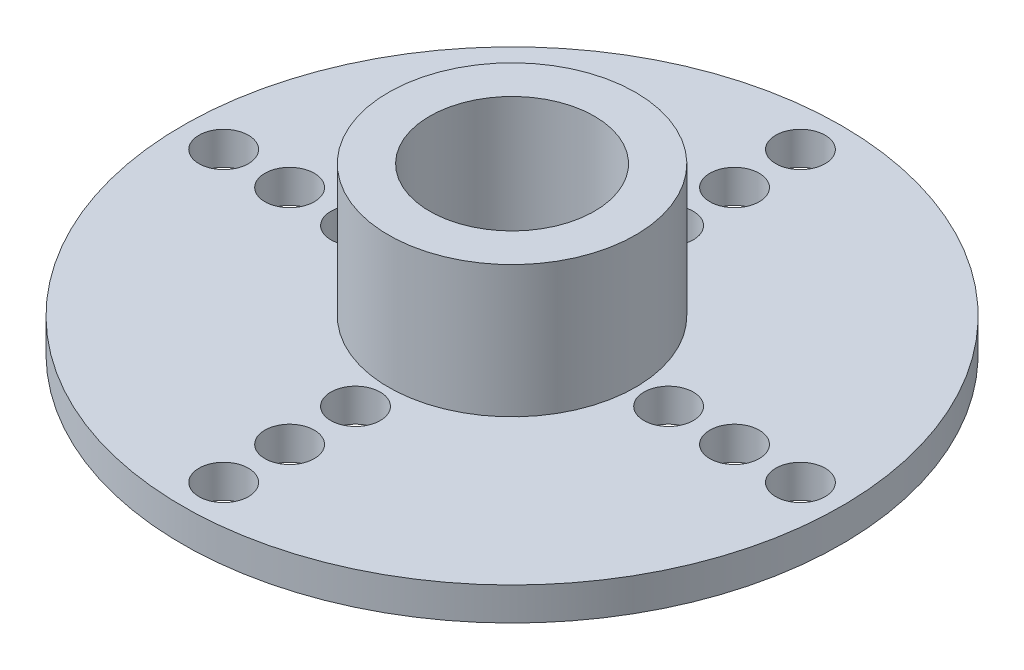
ISO-10303-21;
HEADER;
FILE_DESCRIPTION(('STEP AP214'),'2;1');
FILE_NAME('part.step','',(''),(''),'','','');
FILE_SCHEMA(('AUTOMOTIVE_DESIGN { 1 0 10303 214 1 1 1 1 }'));
ENDSEC;
DATA;
#1=APPLICATION_CONTEXT('core data for automotive mechanical design processes');
#2=APPLICATION_PROTOCOL_DEFINITION('international standard','automotive_design',2000,#1);
#3=PRODUCT_CONTEXT('',#1,'mechanical');
#4=PRODUCT('Part','Part','',(#3));
#5=PRODUCT_RELATED_PRODUCT_CATEGORY('part','',(#4));
#6=PRODUCT_DEFINITION_FORMATION('','',#4);
#7=PRODUCT_DEFINITION_CONTEXT('part definition',#1,'design');
#8=PRODUCT_DEFINITION('design','',#6,#7);
#9=PRODUCT_DEFINITION_SHAPE('','',#8);
#10=(LENGTH_UNIT() NAMED_UNIT(*) SI_UNIT(.MILLI.,.METRE.));
#11=(NAMED_UNIT(*) PLANE_ANGLE_UNIT() SI_UNIT($,.RADIAN.));
#12=(NAMED_UNIT(*) SI_UNIT($,.STERADIAN.) SOLID_ANGLE_UNIT());
#13=UNCERTAINTY_MEASURE_WITH_UNIT(LENGTH_MEASURE(1.E-05),#10,'distance_accuracy_value','');
#14=(GEOMETRIC_REPRESENTATION_CONTEXT(3) GLOBAL_UNCERTAINTY_ASSIGNED_CONTEXT((#13)) GLOBAL_UNIT_ASSIGNED_CONTEXT((#10,
#11,#12)) REPRESENTATION_CONTEXT('',''));
#15=CARTESIAN_POINT('',(0.,0.,0.));
#16=DIRECTION('',(0.,0.,1.));
#17=DIRECTION('',(1.,0.,0.));
#18=AXIS2_PLACEMENT_3D('',#15,#16,#17);
#19=CARTESIAN_POINT('',(0.,5.,0.));
#20=DIRECTION('',(0.,-1.,0.));
#21=DIRECTION('',(0.,0.,-1.));
#22=AXIS2_PLACEMENT_3D('',#19,#20,#21);
#23=CYLINDRICAL_SURFACE('',#22,3.75);
#24=CARTESIAN_POINT('',(0.,5.,0.));
#25=DIRECTION('',(0.,-1.,0.));
#26=DIRECTION('',(0.,0.,-1.));
#27=AXIS2_PLACEMENT_3D('',#24,#25,#26);
#28=CIRCLE('',#27,3.75);
#29=CARTESIAN_POINT('',(0.,5.,-3.75));
#30=VERTEX_POINT('',#29);
#31=EDGE_CURVE('E204',#30,#30,#28,.T.);
#32=ORIENTED_EDGE('',*,*,#31,.T.);
#33=EDGE_LOOP('',(#32));
#34=FACE_BOUND('',#33,.T.);
#35=CARTESIAN_POINT('',(0.,1.,0.));
#36=DIRECTION('',(0.,-1.,0.));
#37=DIRECTION('',(0.,0.,-1.));
#38=AXIS2_PLACEMENT_3D('',#35,#36,#37);
#39=CIRCLE('',#38,3.75);
#40=CARTESIAN_POINT('',(0.,1.,-3.75));
#41=VERTEX_POINT('',#40);
#42=EDGE_CURVE('E48',#41,#41,#39,.T.);
#43=ORIENTED_EDGE('',*,*,#42,.F.);
#44=EDGE_LOOP('',(#43));
#45=FACE_BOUND('',#44,.T.);
#46=ADVANCED_FACE('F33',(#34,#45),#23,.T.);
#47=CARTESIAN_POINT('',(0.,1.,-14.75));
#48=DIRECTION('',(0.,-1.,0.));
#49=DIRECTION('',(0.,0.,-1.));
#50=AXIS2_PLACEMENT_3D('',#47,#48,#49);
#51=PLANE('',#50);
#52=CARTESIAN_POINT('',(0.,1.,0.));
#53=DIRECTION('',(0.,-1.,0.));
#54=DIRECTION('',(0.,0.,-1.));
#55=AXIS2_PLACEMENT_3D('',#52,#53,#54);
#56=CIRCLE('',#55,10.);
#57=CARTESIAN_POINT('',(0.,1.,-10.));
#58=VERTEX_POINT('',#57);
#59=EDGE_CURVE('E199',#58,#58,#56,.T.);
#60=ORIENTED_EDGE('',*,*,#59,.F.);
#61=EDGE_LOOP('',(#60));
#62=FACE_BOUND('',#61,.T.);
#63=ORIENTED_EDGE('',*,*,#42,.T.);
#64=EDGE_LOOP('',(#63));
#65=FACE_BOUND('',#64,.T.);
#66=CARTESIAN_POINT('',(1.0413211676572E-13,1.,-4.75));
#67=DIRECTION('',(0.,1.,0.));
#68=DIRECTION('',(0.,0.,1.));
#69=AXIS2_PLACEMENT_3D('',#66,#67,#68);
#70=CIRCLE('',#69,0.75);
#71=CARTESIAN_POINT('',(1.0413211676572E-13,1.,-4.));
#72=VERTEX_POINT('',#71);
#73=EDGE_CURVE('E69',#72,#72,#70,.T.);
#74=ORIENTED_EDGE('',*,*,#73,.F.);
#75=EDGE_LOOP('',(#74));
#76=FACE_BOUND('',#75,.T.);
#77=CARTESIAN_POINT('',(0.,1.,-6.75));
#78=DIRECTION('',(0.,1.,0.));
#79=DIRECTION('',(0.,0.,1.));
#80=AXIS2_PLACEMENT_3D('',#77,#78,#79);
#81=CIRCLE('',#80,0.75);
#82=CARTESIAN_POINT('',(0.,1.,-6.));
#83=VERTEX_POINT('',#82);
#84=EDGE_CURVE('E75',#83,#83,#81,.T.);
#85=ORIENTED_EDGE('',*,*,#84,.F.);
#86=EDGE_LOOP('',(#85));
#87=FACE_BOUND('',#86,.T.);
#88=CARTESIAN_POINT('',(0.,1.,-8.75));
#89=DIRECTION('',(0.,1.,0.));
#90=DIRECTION('',(0.,0.,1.));
#91=AXIS2_PLACEMENT_3D('',#88,#89,#90);
#92=CIRCLE('',#91,0.75);
#93=CARTESIAN_POINT('',(0.,1.,-8.));
#94=VERTEX_POINT('',#93);
#95=EDGE_CURVE('E81',#94,#94,#92,.T.);
#96=ORIENTED_EDGE('',*,*,#95,.F.);
#97=EDGE_LOOP('',(#96));
#98=FACE_BOUND('',#97,.T.);
#99=CARTESIAN_POINT('',(8.75,1.,0.));
#100=DIRECTION('',(0.,-1.,0.));
#101=DIRECTION('',(0.,0.,-1.));
#102=AXIS2_PLACEMENT_3D('',#99,#100,#101);
#103=CIRCLE('',#102,0.749999999999998);
#104=CARTESIAN_POINT('',(8.75,1.,-0.749999999999998));
#105=VERTEX_POINT('',#104);
#106=EDGE_CURVE('E183',#105,#105,#103,.T.);
#107=ORIENTED_EDGE('',*,*,#106,.T.);
#108=EDGE_LOOP('',(#107));
#109=FACE_BOUND('',#108,.T.);
#110=CARTESIAN_POINT('',(6.75,1.,0.));
#111=DIRECTION('',(0.,-1.,0.));
#112=DIRECTION('',(0.,0.,-1.));
#113=AXIS2_PLACEMENT_3D('',#110,#111,#112);
#114=CIRCLE('',#113,0.749999999999999);
#115=CARTESIAN_POINT('',(6.75,1.,-0.749999999999999));
#116=VERTEX_POINT('',#115);
#117=EDGE_CURVE('E186',#116,#116,#114,.T.);
#118=ORIENTED_EDGE('',*,*,#117,.T.);
#119=EDGE_LOOP('',(#118));
#120=FACE_BOUND('',#119,.T.);
#121=CARTESIAN_POINT('',(4.75,1.,0.));
#122=DIRECTION('',(0.,-1.,0.));
#123=DIRECTION('',(0.,0.,-1.));
#124=AXIS2_PLACEMENT_3D('',#121,#122,#123);
#125=CIRCLE('',#124,0.749999999999999);
#126=CARTESIAN_POINT('',(4.75,1.,-0.749999999999999));
#127=VERTEX_POINT('',#126);
#128=EDGE_CURVE('E189',#127,#127,#125,.T.);
#129=ORIENTED_EDGE('',*,*,#128,.T.);
#130=EDGE_LOOP('',(#129));
#131=FACE_BOUND('',#130,.T.);
#132=CARTESIAN_POINT('',(1.0413211676572E-13,1.,4.75));
#133=DIRECTION('',(0.,1.,0.));
#134=DIRECTION('',(0.,0.,-1.));
#135=AXIS2_PLACEMENT_3D('',#132,#133,#134);
#136=CIRCLE('',#135,0.75);
#137=CARTESIAN_POINT('',(1.0413211676572E-13,1.,4.));
#138=VERTEX_POINT('',#137);
#139=EDGE_CURVE('E63',#138,#138,#136,.T.);
#140=ORIENTED_EDGE('',*,*,#139,.F.);
#141=EDGE_LOOP('',(#140));
#142=FACE_BOUND('',#141,.T.);
#143=CARTESIAN_POINT('',(0.,1.,6.75));
#144=DIRECTION('',(0.,1.,0.));
#145=DIRECTION('',(0.,0.,-1.));
#146=AXIS2_PLACEMENT_3D('',#143,#144,#145);
#147=CIRCLE('',#146,0.75);
#148=CARTESIAN_POINT('',(0.,1.,6.));
#149=VERTEX_POINT('',#148);
#150=EDGE_CURVE('E57',#149,#149,#147,.T.);
#151=ORIENTED_EDGE('',*,*,#150,.F.);
#152=EDGE_LOOP('',(#151));
#153=FACE_BOUND('',#152,.T.);
#154=CARTESIAN_POINT('',(0.,1.,8.75));
#155=DIRECTION('',(0.,1.,0.));
#156=DIRECTION('',(0.,0.,-1.));
#157=AXIS2_PLACEMENT_3D('',#154,#155,#156);
#158=CIRCLE('',#157,0.75);
#159=CARTESIAN_POINT('',(0.,1.,8.));
#160=VERTEX_POINT('',#159);
#161=EDGE_CURVE('E50',#160,#160,#158,.T.);
#162=ORIENTED_EDGE('',*,*,#161,.F.);
#163=EDGE_LOOP('',(#162));
#164=FACE_BOUND('',#163,.T.);
#165=CARTESIAN_POINT('',(-6.75,1.,0.));
#166=DIRECTION('',(0.,-1.,0.));
#167=DIRECTION('',(0.,0.,-1.));
#168=AXIS2_PLACEMENT_3D('',#165,#166,#167);
#169=CIRCLE('',#168,0.750000000000085);
#170=CARTESIAN_POINT('',(-6.75,1.,-0.750000000000085));
#171=VERTEX_POINT('',#170);
#172=EDGE_CURVE('E175',#171,#171,#169,.F.);
#173=ORIENTED_EDGE('',*,*,#172,.F.);
#174=EDGE_LOOP('',(#173));
#175=FACE_BOUND('',#174,.T.);
#176=CARTESIAN_POINT('',(-8.75,1.,0.));
#177=DIRECTION('',(0.,-1.,0.));
#178=DIRECTION('',(0.,0.,-1.));
#179=AXIS2_PLACEMENT_3D('',#176,#177,#178);
#180=CIRCLE('',#179,0.75000000000011);
#181=CARTESIAN_POINT('',(-8.75,1.,-0.75000000000011));
#182=VERTEX_POINT('',#181);
#183=EDGE_CURVE('E178',#182,#182,#180,.F.);
#184=ORIENTED_EDGE('',*,*,#183,.F.);
#185=EDGE_LOOP('',(#184));
#186=FACE_BOUND('',#185,.T.);
#187=CARTESIAN_POINT('',(-4.75,1.,2.08264233531441E-13));
#188=DIRECTION('',(0.,-1.,0.));
#189=DIRECTION('',(0.,0.,-1.));
#190=AXIS2_PLACEMENT_3D('',#187,#188,#189);
#191=CIRCLE('',#190,0.749999999999999);
#192=CARTESIAN_POINT('',(-4.75,1.,-0.74999999999979));
#193=VERTEX_POINT('',#192);
#194=EDGE_CURVE('E194',#193,#193,#191,.F.);
#195=ORIENTED_EDGE('',*,*,#194,.F.);
#196=EDGE_LOOP('',(#195));
#197=FACE_BOUND('',#196,.T.);
#198=ADVANCED_FACE('F106',(#62,#65,#76,#87,#98,#109,#120,#131,#142,#153,#164,#175,#186,#197),
#51,.F.);
#199=CARTESIAN_POINT('',(0.,0.,-14.75));
#200=DIRECTION('',(0.,-1.,0.));
#201=DIRECTION('',(0.,0.,-1.));
#202=AXIS2_PLACEMENT_3D('',#199,#200,#201);
#203=PLANE('',#202);
#204=CARTESIAN_POINT('',(0.,0.,0.));
#205=DIRECTION('',(0.,-1.,0.));
#206=DIRECTION('',(0.,0.,-1.));
#207=AXIS2_PLACEMENT_3D('',#204,#205,#206);
#208=CIRCLE('',#207,10.);
#209=CARTESIAN_POINT('',(0.,0.,-10.));
#210=VERTEX_POINT('',#209);
#211=EDGE_CURVE('E192',#210,#210,#208,.T.);
#212=ORIENTED_EDGE('',*,*,#211,.T.);
#213=EDGE_LOOP('',(#212));
#214=FACE_BOUND('',#213,.T.);
#215=CARTESIAN_POINT('',(0.,0.,-6.75));
#216=DIRECTION('',(0.,1.,0.));
#217=DIRECTION('',(0.,0.,1.));
#218=AXIS2_PLACEMENT_3D('',#215,#216,#217);
#219=CIRCLE('',#218,0.75);
#220=CARTESIAN_POINT('',(0.,0.,-6.));
#221=VERTEX_POINT('',#220);
#222=EDGE_CURVE('E72',#221,#221,#219,.T.);
#223=ORIENTED_EDGE('',*,*,#222,.T.);
#224=EDGE_LOOP('',(#223));
#225=FACE_BOUND('',#224,.T.);
#226=CARTESIAN_POINT('',(0.,0.,-8.75));
#227=DIRECTION('',(0.,1.,0.));
#228=DIRECTION('',(0.,0.,1.));
#229=AXIS2_PLACEMENT_3D('',#226,#227,#228);
#230=CIRCLE('',#229,0.75);
#231=CARTESIAN_POINT('',(0.,0.,-8.));
#232=VERTEX_POINT('',#231);
#233=EDGE_CURVE('E78',#232,#232,#230,.T.);
#234=ORIENTED_EDGE('',*,*,#233,.T.);
#235=EDGE_LOOP('',(#234));
#236=FACE_BOUND('',#235,.T.);
#237=CARTESIAN_POINT('',(1.0413211676572E-13,0.,-4.75));
#238=DIRECTION('',(0.,1.,0.));
#239=DIRECTION('',(0.,0.,1.));
#240=AXIS2_PLACEMENT_3D('',#237,#238,#239);
#241=CIRCLE('',#240,0.75);
#242=CARTESIAN_POINT('',(1.0413211676572E-13,0.,-4.));
#243=VERTEX_POINT('',#242);
#244=EDGE_CURVE('E66',#243,#243,#241,.T.);
#245=ORIENTED_EDGE('',*,*,#244,.T.);
#246=EDGE_LOOP('',(#245));
#247=FACE_BOUND('',#246,.T.);
#248=CARTESIAN_POINT('',(0.,0.,0.));
#249=DIRECTION('',(0.,1.,0.));
#250=DIRECTION('',(0.,0.,1.));
#251=AXIS2_PLACEMENT_3D('',#248,#249,#250);
#252=CIRCLE('',#251,0.75);
#253=CARTESIAN_POINT('',(0.,0.,0.75));
#254=VERTEX_POINT('',#253);
#255=EDGE_CURVE('E37',#254,#254,#252,.T.);
#256=ORIENTED_EDGE('',*,*,#255,.T.);
#257=EDGE_LOOP('',(#256));
#258=FACE_BOUND('',#257,.T.);
#259=CARTESIAN_POINT('',(0.,0.,6.75));
#260=DIRECTION('',(0.,1.,0.));
#261=DIRECTION('',(0.,0.,-1.));
#262=AXIS2_PLACEMENT_3D('',#259,#260,#261);
#263=CIRCLE('',#262,0.75);
#264=CARTESIAN_POINT('',(0.,0.,6.));
#265=VERTEX_POINT('',#264);
#266=EDGE_CURVE('E53',#265,#265,#263,.T.);
#267=ORIENTED_EDGE('',*,*,#266,.T.);
#268=EDGE_LOOP('',(#267));
#269=FACE_BOUND('',#268,.T.);
#270=CARTESIAN_POINT('',(1.0413211676572E-13,0.,4.75));
#271=DIRECTION('',(0.,1.,0.));
#272=DIRECTION('',(0.,0.,-1.));
#273=AXIS2_PLACEMENT_3D('',#270,#271,#272);
#274=CIRCLE('',#273,0.75);
#275=CARTESIAN_POINT('',(1.0413211676572E-13,0.,4.));
#276=VERTEX_POINT('',#275);
#277=EDGE_CURVE('E60',#276,#276,#274,.T.);
#278=ORIENTED_EDGE('',*,*,#277,.T.);
#279=EDGE_LOOP('',(#278));
#280=FACE_BOUND('',#279,.T.);
#281=CARTESIAN_POINT('',(0.,0.,8.75));
#282=DIRECTION('',(0.,1.,0.));
#283=DIRECTION('',(0.,0.,-1.));
#284=AXIS2_PLACEMENT_3D('',#281,#282,#283);
#285=CIRCLE('',#284,0.75);
#286=CARTESIAN_POINT('',(0.,0.,8.));
#287=VERTEX_POINT('',#286);
#288=EDGE_CURVE('E54',#287,#287,#285,.T.);
#289=ORIENTED_EDGE('',*,*,#288,.T.);
#290=EDGE_LOOP('',(#289));
#291=FACE_BOUND('',#290,.T.);
#292=CARTESIAN_POINT('',(8.75,0.,0.));
#293=DIRECTION('',(0.,-1.,0.));
#294=DIRECTION('',(0.,0.,-1.));
#295=AXIS2_PLACEMENT_3D('',#292,#293,#294);
#296=CIRCLE('',#295,0.749999999999998);
#297=CARTESIAN_POINT('',(8.75,0.,-0.749999999999998));
#298=VERTEX_POINT('',#297);
#299=EDGE_CURVE('E154',#298,#298,#296,.T.);
#300=ORIENTED_EDGE('',*,*,#299,.F.);
#301=EDGE_LOOP('',(#300));
#302=FACE_BOUND('',#301,.T.);
#303=CARTESIAN_POINT('',(6.75,0.,0.));
#304=DIRECTION('',(0.,-1.,0.));
#305=DIRECTION('',(0.,0.,-1.));
#306=AXIS2_PLACEMENT_3D('',#303,#304,#305);
#307=CIRCLE('',#306,0.749999999999999);
#308=CARTESIAN_POINT('',(6.75,0.,-0.749999999999999));
#309=VERTEX_POINT('',#308);
#310=EDGE_CURVE('E158',#309,#309,#307,.T.);
#311=ORIENTED_EDGE('',*,*,#310,.F.);
#312=EDGE_LOOP('',(#311));
#313=FACE_BOUND('',#312,.T.);
#314=CARTESIAN_POINT('',(4.75,0.,0.));
#315=DIRECTION('',(0.,-1.,0.));
#316=DIRECTION('',(0.,0.,-1.));
#317=AXIS2_PLACEMENT_3D('',#314,#315,#316);
#318=CIRCLE('',#317,0.749999999999999);
#319=CARTESIAN_POINT('',(4.75,0.,-0.749999999999999));
#320=VERTEX_POINT('',#319);
#321=EDGE_CURVE('E162',#320,#320,#318,.T.);
#322=ORIENTED_EDGE('',*,*,#321,.F.);
#323=EDGE_LOOP('',(#322));
#324=FACE_BOUND('',#323,.T.);
#325=CARTESIAN_POINT('',(-6.75,0.,0.));
#326=DIRECTION('',(0.,-1.,0.));
#327=DIRECTION('',(0.,0.,-1.));
#328=AXIS2_PLACEMENT_3D('',#325,#326,#327);
#329=CIRCLE('',#328,0.750000000000085);
#330=CARTESIAN_POINT('',(-6.75,0.,-0.750000000000085));
#331=VERTEX_POINT('',#330);
#332=EDGE_CURVE('E166',#331,#331,#329,.F.);
#333=ORIENTED_EDGE('',*,*,#332,.T.);
#334=EDGE_LOOP('',(#333));
#335=FACE_BOUND('',#334,.T.);
#336=CARTESIAN_POINT('',(-8.75,0.,0.));
#337=DIRECTION('',(0.,-1.,0.));
#338=DIRECTION('',(0.,0.,-1.));
#339=AXIS2_PLACEMENT_3D('',#336,#337,#338);
#340=CIRCLE('',#339,0.75000000000011);
#341=CARTESIAN_POINT('',(-8.75,0.,-0.75000000000011));
#342=VERTEX_POINT('',#341);
#343=EDGE_CURVE('E170',#342,#342,#340,.F.);
#344=ORIENTED_EDGE('',*,*,#343,.T.);
#345=EDGE_LOOP('',(#344));
#346=FACE_BOUND('',#345,.T.);
#347=CARTESIAN_POINT('',(-4.75,0.,2.08264233531441E-13));
#348=DIRECTION('',(0.,-1.,0.));
#349=DIRECTION('',(0.,0.,-1.));
#350=AXIS2_PLACEMENT_3D('',#347,#348,#349);
#351=CIRCLE('',#350,0.749999999999999);
#352=CARTESIAN_POINT('',(-4.75,0.,-0.74999999999979));
#353=VERTEX_POINT('',#352);
#354=EDGE_CURVE('E173',#353,#353,#351,.F.);
#355=ORIENTED_EDGE('',*,*,#354,.T.);
#356=EDGE_LOOP('',(#355));
#357=FACE_BOUND('',#356,.T.);
#358=ADVANCED_FACE('F35',(#214,#225,#236,#247,#258,#269,#280,#291,#302,#313,#324,#335,#346,
#357),#203,.T.);
#359=CARTESIAN_POINT('',(0.,1.,0.));
#360=DIRECTION('',(0.,1.,0.));
#361=DIRECTION('',(0.,0.,1.));
#362=AXIS2_PLACEMENT_3D('',#359,#360,#361);
#363=CIRCLE('',#362,0.75);
#364=CARTESIAN_POINT('',(0.,1.,0.75));
#365=VERTEX_POINT('',#364);
#366=EDGE_CURVE('E41',#365,#365,#363,.T.);
#367=ORIENTED_EDGE('',*,*,#366,.F.);
#368=EDGE_LOOP('',(#367));
#369=FACE_BOUND('',#368,.T.);
#370=CARTESIAN_POINT('',(0.,1.,0.));
#371=DIRECTION('',(0.,-1.,0.));
#372=DIRECTION('',(0.,0.,-1.));
#373=AXIS2_PLACEMENT_3D('',#370,#371,#372);
#374=CIRCLE('',#373,2.5);
#375=CARTESIAN_POINT('',(0.,1.,-2.5));
#376=VERTEX_POINT('',#375);
#377=EDGE_CURVE('E11',#376,#376,#374,.T.);
#378=ORIENTED_EDGE('',*,*,#377,.F.);
#379=EDGE_LOOP('',(#378));
#380=FACE_BOUND('',#379,.T.);
#381=ADVANCED_FACE('F102',(#369,#380),#51,.F.);
#382=CARTESIAN_POINT('',(0.,1.,0.));
#383=DIRECTION('',(0.,-1.,0.));
#384=DIRECTION('',(0.,0.,-1.));
#385=AXIS2_PLACEMENT_3D('',#382,#383,#384);
#386=CYLINDRICAL_SURFACE('',#385,0.75);
#387=ORIENTED_EDGE('',*,*,#366,.T.);
#388=EDGE_LOOP('',(#387));
#389=FACE_BOUND('',#388,.T.);
#390=ORIENTED_EDGE('',*,*,#255,.F.);
#391=EDGE_LOOP('',(#390));
#392=FACE_BOUND('',#391,.T.);
#393=ADVANCED_FACE('F92',(#389,#392),#386,.F.);
#394=CARTESIAN_POINT('',(0.,1.,-8.75));
#395=DIRECTION('',(0.,-1.,0.));
#396=DIRECTION('',(0.,0.,-1.));
#397=AXIS2_PLACEMENT_3D('',#394,#395,#396);
#398=CYLINDRICAL_SURFACE('',#397,0.75);
#399=ORIENTED_EDGE('',*,*,#95,.T.);
#400=EDGE_LOOP('',(#399));
#401=FACE_BOUND('',#400,.T.);
#402=ORIENTED_EDGE('',*,*,#233,.F.);
#403=EDGE_LOOP('',(#402));
#404=FACE_BOUND('',#403,.T.);
#405=ADVANCED_FACE('F89',(#401,#404),#398,.F.);
#406=CARTESIAN_POINT('',(0.,1.,-6.75));
#407=DIRECTION('',(0.,-1.,0.));
#408=DIRECTION('',(0.,0.,-1.));
#409=AXIS2_PLACEMENT_3D('',#406,#407,#408);
#410=CYLINDRICAL_SURFACE('',#409,0.75);
#411=ORIENTED_EDGE('',*,*,#84,.T.);
#412=EDGE_LOOP('',(#411));
#413=FACE_BOUND('',#412,.T.);
#414=ORIENTED_EDGE('',*,*,#222,.F.);
#415=EDGE_LOOP('',(#414));
#416=FACE_BOUND('',#415,.T.);
#417=ADVANCED_FACE('F91',(#413,#416),#410,.F.);
#418=CARTESIAN_POINT('',(1.0413211676572E-13,1.,-4.75));
#419=DIRECTION('',(0.,-1.,0.));
#420=DIRECTION('',(0.,0.,-1.));
#421=AXIS2_PLACEMENT_3D('',#418,#419,#420);
#422=CYLINDRICAL_SURFACE('',#421,0.75);
#423=ORIENTED_EDGE('',*,*,#73,.T.);
#424=EDGE_LOOP('',(#423));
#425=FACE_BOUND('',#424,.T.);
#426=ORIENTED_EDGE('',*,*,#244,.F.);
#427=EDGE_LOOP('',(#426));
#428=FACE_BOUND('',#427,.T.);
#429=ADVANCED_FACE('F99',(#425,#428),#422,.F.);
#430=CARTESIAN_POINT('',(1.0413211676572E-13,1.,4.75));
#431=DIRECTION('',(0.,-1.,0.));
#432=DIRECTION('',(0.,0.,-1.));
#433=AXIS2_PLACEMENT_3D('',#430,#431,#432);
#434=CYLINDRICAL_SURFACE('',#433,0.75);
#435=ORIENTED_EDGE('',*,*,#139,.T.);
#436=EDGE_LOOP('',(#435));
#437=FACE_BOUND('',#436,.T.);
#438=ORIENTED_EDGE('',*,*,#277,.F.);
#439=EDGE_LOOP('',(#438));
#440=FACE_BOUND('',#439,.T.);
#441=ADVANCED_FACE('F127',(#437,#440),#434,.F.);
#442=CARTESIAN_POINT('',(0.,1.,6.75));
#443=DIRECTION('',(0.,-1.,0.));
#444=DIRECTION('',(0.,0.,-1.));
#445=AXIS2_PLACEMENT_3D('',#442,#443,#444);
#446=CYLINDRICAL_SURFACE('',#445,0.75);
#447=ORIENTED_EDGE('',*,*,#150,.T.);
#448=EDGE_LOOP('',(#447));
#449=FACE_BOUND('',#448,.T.);
#450=ORIENTED_EDGE('',*,*,#266,.F.);
#451=EDGE_LOOP('',(#450));
#452=FACE_BOUND('',#451,.T.);
#453=ADVANCED_FACE('F123',(#449,#452),#446,.F.);
#454=CARTESIAN_POINT('',(0.,1.,8.75));
#455=DIRECTION('',(0.,-1.,0.));
#456=DIRECTION('',(0.,0.,-1.));
#457=AXIS2_PLACEMENT_3D('',#454,#455,#456);
#458=CYLINDRICAL_SURFACE('',#457,0.75);
#459=ORIENTED_EDGE('',*,*,#161,.T.);
#460=EDGE_LOOP('',(#459));
#461=FACE_BOUND('',#460,.T.);
#462=ORIENTED_EDGE('',*,*,#288,.F.);
#463=EDGE_LOOP('',(#462));
#464=FACE_BOUND('',#463,.T.);
#465=ADVANCED_FACE('F119',(#461,#464),#458,.F.);
#466=CARTESIAN_POINT('',(0.,5.,0.));
#467=DIRECTION('',(0.,-1.,0.));
#468=DIRECTION('',(0.,0.,-1.));
#469=AXIS2_PLACEMENT_3D('',#466,#467,#468);
#470=CYLINDRICAL_SURFACE('',#469,2.5);
#471=CARTESIAN_POINT('',(0.,5.,0.));
#472=DIRECTION('',(0.,-1.,0.));
#473=DIRECTION('',(0.,0.,-1.));
#474=AXIS2_PLACEMENT_3D('',#471,#472,#473);
#475=CIRCLE('',#474,2.5);
#476=CARTESIAN_POINT('',(0.,5.,-2.5));
#477=VERTEX_POINT('',#476);
#478=EDGE_CURVE('E202',#477,#477,#475,.T.);
#479=ORIENTED_EDGE('',*,*,#478,.F.);
#480=EDGE_LOOP('',(#479));
#481=FACE_BOUND('',#480,.T.);
#482=ORIENTED_EDGE('',*,*,#377,.T.);
#483=EDGE_LOOP('',(#482));
#484=FACE_BOUND('',#483,.T.);
#485=ADVANCED_FACE('F122',(#481,#484),#470,.F.);
#486=CARTESIAN_POINT('',(0.,5.,0.));
#487=DIRECTION('',(0.,-1.,0.));
#488=DIRECTION('',(0.,0.,-1.));
#489=AXIS2_PLACEMENT_3D('',#486,#487,#488);
#490=PLANE('',#489);
#491=ORIENTED_EDGE('',*,*,#478,.T.);
#492=EDGE_LOOP('',(#491));
#493=FACE_BOUND('',#492,.T.);
#494=ORIENTED_EDGE('',*,*,#31,.F.);
#495=EDGE_LOOP('',(#494));
#496=FACE_BOUND('',#495,.T.);
#497=ADVANCED_FACE('F117',(#493,#496),#490,.F.);
#498=CARTESIAN_POINT('',(0.,5.,0.));
#499=DIRECTION('',(0.,-1.,0.));
#500=DIRECTION('',(0.,0.,-1.));
#501=AXIS2_PLACEMENT_3D('',#498,#499,#500);
#502=CYLINDRICAL_SURFACE('',#501,10.);
#503=ORIENTED_EDGE('',*,*,#211,.F.);
#504=EDGE_LOOP('',(#503));
#505=FACE_BOUND('',#504,.T.);
#506=ORIENTED_EDGE('',*,*,#59,.T.);
#507=EDGE_LOOP('',(#506));
#508=FACE_BOUND('',#507,.T.);
#509=ADVANCED_FACE('F259',(#505,#508),#502,.T.);
#510=CARTESIAN_POINT('',(4.75,1.,0.));
#511=DIRECTION('',(0.,-1.,0.));
#512=DIRECTION('',(0.,0.,-1.));
#513=AXIS2_PLACEMENT_3D('',#510,#511,#512);
#514=CYLINDRICAL_SURFACE('',#513,0.749999999999999);
#515=ORIENTED_EDGE('',*,*,#128,.F.);
#516=EDGE_LOOP('',(#515));
#517=FACE_BOUND('',#516,.T.);
#518=ORIENTED_EDGE('',*,*,#321,.T.);
#519=EDGE_LOOP('',(#518));
#520=FACE_BOUND('',#519,.T.);
#521=ADVANCED_FACE('F256',(#517,#520),#514,.F.);
#522=CARTESIAN_POINT('',(6.75,1.,0.));
#523=DIRECTION('',(0.,-1.,0.));
#524=DIRECTION('',(0.,0.,-1.));
#525=AXIS2_PLACEMENT_3D('',#522,#523,#524);
#526=CYLINDRICAL_SURFACE('',#525,0.749999999999999);
#527=ORIENTED_EDGE('',*,*,#117,.F.);
#528=EDGE_LOOP('',(#527));
#529=FACE_BOUND('',#528,.T.);
#530=ORIENTED_EDGE('',*,*,#310,.T.);
#531=EDGE_LOOP('',(#530));
#532=FACE_BOUND('',#531,.T.);
#533=ADVANCED_FACE('F251',(#529,#532),#526,.F.);
#534=CARTESIAN_POINT('',(8.75,1.,0.));
#535=DIRECTION('',(0.,-1.,0.));
#536=DIRECTION('',(0.,0.,-1.));
#537=AXIS2_PLACEMENT_3D('',#534,#535,#536);
#538=CYLINDRICAL_SURFACE('',#537,0.749999999999998);
#539=ORIENTED_EDGE('',*,*,#106,.F.);
#540=EDGE_LOOP('',(#539));
#541=FACE_BOUND('',#540,.T.);
#542=ORIENTED_EDGE('',*,*,#299,.T.);
#543=EDGE_LOOP('',(#542));
#544=FACE_BOUND('',#543,.T.);
#545=ADVANCED_FACE('F242',(#541,#544),#538,.F.);
#546=CARTESIAN_POINT('',(-8.75,1.,0.));
#547=DIRECTION('',(0.,-1.,0.));
#548=DIRECTION('',(0.,0.,-1.));
#549=AXIS2_PLACEMENT_3D('',#546,#547,#548);
#550=CYLINDRICAL_SURFACE('',#549,0.75000000000011);
#551=ORIENTED_EDGE('',*,*,#183,.T.);
#552=EDGE_LOOP('',(#551));
#553=FACE_BOUND('',#552,.T.);
#554=ORIENTED_EDGE('',*,*,#343,.F.);
#555=EDGE_LOOP('',(#554));
#556=FACE_BOUND('',#555,.T.);
#557=ADVANCED_FACE('F238',(#553,#556),#550,.F.);
#558=CARTESIAN_POINT('',(-6.75,1.,0.));
#559=DIRECTION('',(0.,-1.,0.));
#560=DIRECTION('',(0.,0.,-1.));
#561=AXIS2_PLACEMENT_3D('',#558,#559,#560);
#562=CYLINDRICAL_SURFACE('',#561,0.750000000000085);
#563=ORIENTED_EDGE('',*,*,#172,.T.);
#564=EDGE_LOOP('',(#563));
#565=FACE_BOUND('',#564,.T.);
#566=ORIENTED_EDGE('',*,*,#332,.F.);
#567=EDGE_LOOP('',(#566));
#568=FACE_BOUND('',#567,.T.);
#569=ADVANCED_FACE('F241',(#565,#568),#562,.F.);
#570=CARTESIAN_POINT('',(-4.75,1.,2.08264233531441E-13));
#571=DIRECTION('',(0.,-1.,0.));
#572=DIRECTION('',(0.,0.,-1.));
#573=AXIS2_PLACEMENT_3D('',#570,#571,#572);
#574=CYLINDRICAL_SURFACE('',#573,0.749999999999999);
#575=ORIENTED_EDGE('',*,*,#194,.T.);
#576=EDGE_LOOP('',(#575));
#577=FACE_BOUND('',#576,.T.);
#578=ORIENTED_EDGE('',*,*,#354,.F.);
#579=EDGE_LOOP('',(#578));
#580=FACE_BOUND('',#579,.T.);
#581=ADVANCED_FACE('F248',(#577,#580),#574,.F.);
#582=CLOSED_SHELL('',(#46,#198,#358,#381,#393,#405,#417,#429,#441,#453,#465,#485,#497,#509,#521,
#533,#545,#557,#569,#581));
#583=MANIFOLD_SOLID_BREP('B2',#582);
#584=ADVANCED_BREP_SHAPE_REPRESENTATION('',(#18,#583),#14);
#585=SHAPE_DEFINITION_REPRESENTATION(#9,#584);
ENDSEC;
END-ISO-10303-21;
